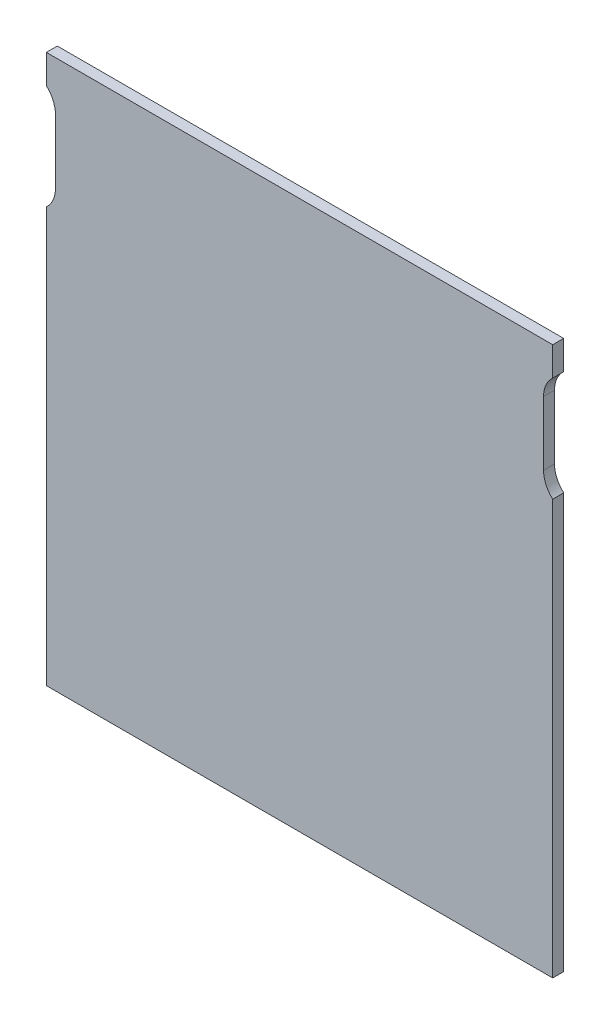
ISO-10303-21;
HEADER;
FILE_DESCRIPTION(('STEP AP214'),'2;1');
FILE_NAME('part.step','',(''),(''),'','','');
FILE_SCHEMA(('AUTOMOTIVE_DESIGN { 1 0 10303 214 1 1 1 1 }'));
ENDSEC;
DATA;
#1=APPLICATION_CONTEXT('core data for automotive mechanical design processes');
#2=APPLICATION_PROTOCOL_DEFINITION('international standard','automotive_design',2000,#1);
#3=PRODUCT_CONTEXT('',#1,'mechanical');
#4=PRODUCT('Part','Part','',(#3));
#5=PRODUCT_RELATED_PRODUCT_CATEGORY('part','',(#4));
#6=PRODUCT_DEFINITION_FORMATION('','',#4);
#7=PRODUCT_DEFINITION_CONTEXT('part definition',#1,'design');
#8=PRODUCT_DEFINITION('design','',#6,#7);
#9=PRODUCT_DEFINITION_SHAPE('','',#8);
#10=(LENGTH_UNIT() NAMED_UNIT(*) SI_UNIT(.MILLI.,.METRE.));
#11=(NAMED_UNIT(*) PLANE_ANGLE_UNIT() SI_UNIT($,.RADIAN.));
#12=(NAMED_UNIT(*) SI_UNIT($,.STERADIAN.) SOLID_ANGLE_UNIT());
#13=UNCERTAINTY_MEASURE_WITH_UNIT(LENGTH_MEASURE(1.E-05),#10,'distance_accuracy_value','');
#14=(GEOMETRIC_REPRESENTATION_CONTEXT(3) GLOBAL_UNCERTAINTY_ASSIGNED_CONTEXT((#13)) GLOBAL_UNIT_ASSIGNED_CONTEXT((#10,
#11,#12)) REPRESENTATION_CONTEXT('',''));
#15=CARTESIAN_POINT('',(0.,0.,0.));
#16=DIRECTION('',(0.,0.,1.));
#17=DIRECTION('',(1.,0.,0.));
#18=AXIS2_PLACEMENT_3D('',#15,#16,#17);
#19=CARTESIAN_POINT('',(-138.5,-150.,6.));
#20=DIRECTION('',(-1.,0.,0.));
#21=DIRECTION('',(0.,0.,1.));
#22=AXIS2_PLACEMENT_3D('',#19,#20,#21);
#23=PLANE('',#22);
#24=DIRECTION('',(0.,1.,0.));
#25=VECTOR('',#24,1.);
#26=CARTESIAN_POINT('',(-138.5,-150.,0.));
#27=LINE('',#26,#25);
#28=CARTESIAN_POINT('',(-138.5,134.180339887499,0.));
#29=VERTEX_POINT('',#28);
#30=CARTESIAN_POINT('',(-138.5,150.,0.));
#31=VERTEX_POINT('',#30);
#32=EDGE_CURVE('E369',#29,#31,#27,.T.);
#33=ORIENTED_EDGE('',*,*,#32,.F.);
#34=DIRECTION('',(0.,0.,1.));
#35=VECTOR('',#34,1.);
#36=CARTESIAN_POINT('',(-138.5,134.180339887499,-12.));
#37=LINE('',#36,#35);
#38=CARTESIAN_POINT('',(-138.5,134.180339887499,6.));
#39=VERTEX_POINT('',#38);
#40=EDGE_CURVE('E221',#29,#39,#37,.T.);
#41=ORIENTED_EDGE('',*,*,#40,.T.);
#42=DIRECTION('',(0.,1.,0.));
#43=VECTOR('',#42,1.);
#44=CARTESIAN_POINT('',(-138.5,-150.,6.));
#45=LINE('',#44,#43);
#46=CARTESIAN_POINT('',(-138.5,150.,6.));
#47=VERTEX_POINT('',#46);
#48=EDGE_CURVE('E357',#39,#47,#45,.T.);
#49=ORIENTED_EDGE('',*,*,#48,.T.);
#50=DIRECTION('',(0.,0.,-1.));
#51=VECTOR('',#50,1.);
#52=CARTESIAN_POINT('',(-138.5,150.,6.));
#53=LINE('',#52,#51);
#54=EDGE_CURVE('E372',#47,#31,#53,.T.);
#55=ORIENTED_EDGE('',*,*,#54,.T.);
#56=EDGE_LOOP('',(#33,#41,#49,#55));
#57=FACE_BOUND('',#56,.T.);
#58=ADVANCED_FACE('F33',(#57),#23,.T.);
#59=CARTESIAN_POINT('',(-138.5,-150.,6.));
#60=VERTEX_POINT('',#59);
#61=CARTESIAN_POINT('',(-138.5,76.8196601125012,6.));
#62=VERTEX_POINT('',#61);
#63=EDGE_CURVE('E358',#60,#62,#45,.T.);
#64=ORIENTED_EDGE('',*,*,#63,.T.);
#65=DIRECTION('',(0.,0.,1.));
#66=VECTOR('',#65,1.);
#67=CARTESIAN_POINT('',(-138.5,76.8196601125012,-12.));
#68=LINE('',#67,#66);
#69=CARTESIAN_POINT('',(-138.5,76.8196601125012,0.));
#70=VERTEX_POINT('',#69);
#71=EDGE_CURVE('E48',#62,#70,#68,.F.);
#72=ORIENTED_EDGE('',*,*,#71,.T.);
#73=CARTESIAN_POINT('',(-138.5,-150.,0.));
#74=VERTEX_POINT('',#73);
#75=EDGE_CURVE('E351',#74,#70,#27,.T.);
#76=ORIENTED_EDGE('',*,*,#75,.F.);
#77=DIRECTION('',(0.,0.,-1.));
#78=VECTOR('',#77,1.);
#79=CARTESIAN_POINT('',(-138.5,-150.,6.));
#80=LINE('',#79,#78);
#81=EDGE_CURVE('E375',#60,#74,#80,.T.);
#82=ORIENTED_EDGE('',*,*,#81,.F.);
#83=EDGE_LOOP('',(#64,#72,#76,#82));
#84=FACE_BOUND('',#83,.T.);
#85=ADVANCED_FACE('F412',(#84),#23,.T.);
#86=CARTESIAN_POINT('',(138.5,-150.,6.));
#87=DIRECTION('',(-1.,0.,0.));
#88=DIRECTION('',(0.,0.,1.));
#89=AXIS2_PLACEMENT_3D('',#86,#87,#88);
#90=PLANE('',#89);
#91=DIRECTION('',(0.,1.,0.));
#92=VECTOR('',#91,1.);
#93=CARTESIAN_POINT('',(138.5,-150.,6.));
#94=LINE('',#93,#92);
#95=CARTESIAN_POINT('',(138.5,134.180339887499,6.));
#96=VERTEX_POINT('',#95);
#97=CARTESIAN_POINT('',(138.5,150.,6.));
#98=VERTEX_POINT('',#97);
#99=EDGE_CURVE('E350',#96,#98,#94,.T.);
#100=ORIENTED_EDGE('',*,*,#99,.F.);
#101=DIRECTION('',(0.,0.,1.));
#102=VECTOR('',#101,1.);
#103=CARTESIAN_POINT('',(138.5,134.180339887499,-12.));
#104=LINE('',#103,#102);
#105=CARTESIAN_POINT('',(138.5,134.180339887499,0.));
#106=VERTEX_POINT('',#105);
#107=EDGE_CURVE('E289',#96,#106,#104,.F.);
#108=ORIENTED_EDGE('',*,*,#107,.T.);
#109=DIRECTION('',(0.,1.,0.));
#110=VECTOR('',#109,1.);
#111=CARTESIAN_POINT('',(138.5,-150.,0.));
#112=LINE('',#111,#110);
#113=CARTESIAN_POINT('',(138.5,150.,0.));
#114=VERTEX_POINT('',#113);
#115=EDGE_CURVE('E363',#106,#114,#112,.T.);
#116=ORIENTED_EDGE('',*,*,#115,.T.);
#117=DIRECTION('',(0.,0.,-1.));
#118=VECTOR('',#117,1.);
#119=CARTESIAN_POINT('',(138.5,150.,6.));
#120=LINE('',#119,#118);
#121=EDGE_CURVE('E360',#98,#114,#120,.T.);
#122=ORIENTED_EDGE('',*,*,#121,.F.);
#123=EDGE_LOOP('',(#100,#108,#116,#122));
#124=FACE_BOUND('',#123,.T.);
#125=ADVANCED_FACE('F399',(#124),#90,.F.);
#126=CARTESIAN_POINT('',(0.,0.,0.));
#127=DIRECTION('',(0.,0.,1.));
#128=DIRECTION('',(1.,0.,0.));
#129=AXIS2_PLACEMENT_3D('',#126,#127,#128);
#130=PLANE('',#129);
#131=CARTESIAN_POINT('',(-148.5,123.,0.));
#132=DIRECTION('',(0.,0.,1.));
#133=DIRECTION('',(1.,0.,0.));
#134=AXIS2_PLACEMENT_3D('',#131,#132,#133);
#135=CIRCLE('',#134,15.);
#136=CARTESIAN_POINT('',(-133.5,123.,0.));
#137=VERTEX_POINT('',#136);
#138=EDGE_CURVE('E224',#29,#137,#135,.F.);
#139=ORIENTED_EDGE('',*,*,#138,.F.);
#140=ORIENTED_EDGE('',*,*,#32,.T.);
#141=DIRECTION('',(1.,0.,0.));
#142=VECTOR('',#141,1.);
#143=CARTESIAN_POINT('',(-138.5,150.,0.));
#144=LINE('',#143,#142);
#145=EDGE_CURVE('E346',#31,#114,#144,.T.);
#146=ORIENTED_EDGE('',*,*,#145,.T.);
#147=ORIENTED_EDGE('',*,*,#115,.F.);
#148=CARTESIAN_POINT('',(148.5,123.,0.));
#149=DIRECTION('',(0.,0.,1.));
#150=DIRECTION('',(1.,0.,0.));
#151=AXIS2_PLACEMENT_3D('',#148,#149,#150);
#152=CIRCLE('',#151,15.);
#153=CARTESIAN_POINT('',(133.5,123.,0.));
#154=VERTEX_POINT('',#153);
#155=EDGE_CURVE('E292',#106,#154,#152,.T.);
#156=ORIENTED_EDGE('',*,*,#155,.T.);
#157=DIRECTION('',(0.,-1.,0.));
#158=VECTOR('',#157,1.);
#159=CARTESIAN_POINT('',(133.5,-1.0586769556247E-13,0.));
#160=LINE('',#159,#158);
#161=CARTESIAN_POINT('',(133.5,88.,0.));
#162=VERTEX_POINT('',#161);
#163=EDGE_CURVE('E279',#154,#162,#160,.T.);
#164=ORIENTED_EDGE('',*,*,#163,.T.);
#165=CARTESIAN_POINT('',(148.5,88.,0.));
#166=DIRECTION('',(0.,0.,1.));
#167=DIRECTION('',(1.,0.,0.));
#168=AXIS2_PLACEMENT_3D('',#165,#166,#167);
#169=CIRCLE('',#168,15.);
#170=CARTESIAN_POINT('',(138.5,76.8196601125011,0.));
#171=VERTEX_POINT('',#170);
#172=EDGE_CURVE('E286',#162,#171,#169,.T.);
#173=ORIENTED_EDGE('',*,*,#172,.T.);
#174=CARTESIAN_POINT('',(138.5,-150.,0.));
#175=VERTEX_POINT('',#174);
#176=EDGE_CURVE('E364',#175,#171,#112,.T.);
#177=ORIENTED_EDGE('',*,*,#176,.F.);
#178=DIRECTION('',(1.,0.,0.));
#179=VECTOR('',#178,1.);
#180=CARTESIAN_POINT('',(-138.5,-150.,0.));
#181=LINE('',#180,#179);
#182=EDGE_CURVE('E367',#74,#175,#181,.T.);
#183=ORIENTED_EDGE('',*,*,#182,.F.);
#184=ORIENTED_EDGE('',*,*,#75,.T.);
#185=CARTESIAN_POINT('',(-148.5,88.,0.));
#186=DIRECTION('',(0.,0.,1.));
#187=DIRECTION('',(1.,0.,0.));
#188=AXIS2_PLACEMENT_3D('',#185,#186,#187);
#189=CIRCLE('',#188,15.);
#190=CARTESIAN_POINT('',(-133.5,88.,0.));
#191=VERTEX_POINT('',#190);
#192=EDGE_CURVE('E218',#191,#70,#189,.F.);
#193=ORIENTED_EDGE('',*,*,#192,.F.);
#194=DIRECTION('',(0.,-1.,0.));
#195=VECTOR('',#194,1.);
#196=CARTESIAN_POINT('',(-133.5,-1.0586769556247E-13,0.));
#197=LINE('',#196,#195);
#198=EDGE_CURVE('E202',#137,#191,#197,.T.);
#199=ORIENTED_EDGE('',*,*,#198,.F.);
#200=EDGE_LOOP('',(#139,#140,#146,#147,#156,#164,#173,#177,#183,#184,#193,#199));
#201=FACE_BOUND('',#200,.T.);
#202=DIRECTION('',(-0.989743318610787,0.142857142857143,0.));
#203=VECTOR('',#202,1.);
#204=CARTESIAN_POINT('',(-102.071428571429,-120.102566813892,0.));
#205=LINE('',#204,#203);
#206=CARTESIAN_POINT('',(-32.7893962686735,-130.102566813892,0.));
#207=VERTEX_POINT('',#206);
#208=CARTESIAN_POINT('',(-102.071428571429,-120.102566813892,0.));
#209=VERTEX_POINT('',#208);
#210=EDGE_CURVE('E258',#207,#209,#205,.T.);
#211=ORIENTED_EDGE('',*,*,#210,.T.);
#212=DIRECTION('',(-0.142857142857142,-0.989743318610787,0.));
#213=VECTOR('',#212,1.);
#214=CARTESIAN_POINT('',(-103.5,-130.,0.));
#215=LINE('',#214,#213);
#216=CARTESIAN_POINT('',(-103.5,-130.,0.));
#217=VERTEX_POINT('',#216);
#218=EDGE_CURVE('E250',#209,#217,#215,.T.);
#219=ORIENTED_EDGE('',*,*,#218,.T.);
#220=DIRECTION('',(0.989743318610787,-0.142857142857143,0.));
#221=VECTOR('',#220,1.);
#222=CARTESIAN_POINT('',(-103.5,-130.,0.));
#223=LINE('',#222,#221);
#224=CARTESIAN_POINT('',(-34.217967697245,-140.,0.));
#225=VERTEX_POINT('',#224);
#226=EDGE_CURVE('E255',#217,#225,#223,.T.);
#227=ORIENTED_EDGE('',*,*,#226,.T.);
#228=DIRECTION('',(0.142857142857143,0.989743318610787,0.));
#229=VECTOR('',#228,1.);
#230=CARTESIAN_POINT('',(-34.217967697245,-140.,0.));
#231=LINE('',#230,#229);
#232=EDGE_CURVE('E56',#225,#207,#231,.T.);
#233=ORIENTED_EDGE('',*,*,#232,.T.);
#234=EDGE_LOOP('',(#211,#219,#227,#233));
#235=FACE_BOUND('',#234,.T.);
#236=DIRECTION('',(0.142857142857142,-0.989743318610787,0.));
#237=VECTOR('',#236,1.);
#238=CARTESIAN_POINT('',(103.5,-130.,0.));
#239=LINE('',#238,#237);
#240=CARTESIAN_POINT('',(102.071428571429,-120.102566813892,0.));
#241=VERTEX_POINT('',#240);
#242=CARTESIAN_POINT('',(103.5,-130.,0.));
#243=VERTEX_POINT('',#242);
#244=EDGE_CURVE('E319',#241,#243,#239,.T.);
#245=ORIENTED_EDGE('',*,*,#244,.F.);
#246=DIRECTION('',(0.989743318610787,0.142857142857143,0.));
#247=VECTOR('',#246,1.);
#248=CARTESIAN_POINT('',(102.071428571429,-120.102566813892,0.));
#249=LINE('',#248,#247);
#250=CARTESIAN_POINT('',(32.7893962686735,-130.102566813892,0.));
#251=VERTEX_POINT('',#250);
#252=EDGE_CURVE('E324',#251,#241,#249,.T.);
#253=ORIENTED_EDGE('',*,*,#252,.F.);
#254=DIRECTION('',(-0.142857142857143,0.989743318610787,0.));
#255=VECTOR('',#254,1.);
#256=CARTESIAN_POINT('',(34.217967697245,-140.,0.));
#257=LINE('',#256,#255);
#258=CARTESIAN_POINT('',(34.217967697245,-140.,0.));
#259=VERTEX_POINT('',#258);
#260=EDGE_CURVE('E330',#259,#251,#257,.T.);
#261=ORIENTED_EDGE('',*,*,#260,.F.);
#262=DIRECTION('',(-0.989743318610787,-0.142857142857143,0.));
#263=VECTOR('',#262,1.);
#264=CARTESIAN_POINT('',(103.5,-130.,0.));
#265=LINE('',#264,#263);
#266=EDGE_CURVE('E327',#243,#259,#265,.T.);
#267=ORIENTED_EDGE('',*,*,#266,.F.);
#268=EDGE_LOOP('',(#245,#253,#261,#267));
#269=FACE_BOUND('',#268,.T.);
#270=ADVANCED_FACE('F394',(#201,#235,#269),#130,.F.);
#271=CARTESIAN_POINT('',(-138.5,150.,6.));
#272=DIRECTION('',(0.,1.,0.));
#273=DIRECTION('',(-1.,0.,0.));
#274=AXIS2_PLACEMENT_3D('',#271,#272,#273);
#275=PLANE('',#274);
#276=ORIENTED_EDGE('',*,*,#145,.F.);
#277=ORIENTED_EDGE('',*,*,#54,.F.);
#278=DIRECTION('',(1.,0.,0.));
#279=VECTOR('',#278,1.);
#280=CARTESIAN_POINT('',(-138.5,150.,6.));
#281=LINE('',#280,#279);
#282=EDGE_CURVE('E347',#47,#98,#281,.T.);
#283=ORIENTED_EDGE('',*,*,#282,.T.);
#284=ORIENTED_EDGE('',*,*,#121,.T.);
#285=EDGE_LOOP('',(#276,#277,#283,#284));
#286=FACE_BOUND('',#285,.T.);
#287=ADVANCED_FACE('F35',(#286),#275,.T.);
#288=CARTESIAN_POINT('',(-138.5,-150.,6.));
#289=DIRECTION('',(0.,1.,0.));
#290=DIRECTION('',(-1.,0.,0.));
#291=AXIS2_PLACEMENT_3D('',#288,#289,#290);
#292=PLANE('',#291);
#293=ORIENTED_EDGE('',*,*,#182,.T.);
#294=DIRECTION('',(0.,0.,-1.));
#295=VECTOR('',#294,1.);
#296=CARTESIAN_POINT('',(138.5,-150.,6.));
#297=LINE('',#296,#295);
#298=CARTESIAN_POINT('',(138.5,-150.,6.));
#299=VERTEX_POINT('',#298);
#300=EDGE_CURVE('E377',#299,#175,#297,.T.);
#301=ORIENTED_EDGE('',*,*,#300,.F.);
#302=DIRECTION('',(1.,0.,0.));
#303=VECTOR('',#302,1.);
#304=CARTESIAN_POINT('',(-138.5,-150.,6.));
#305=LINE('',#304,#303);
#306=EDGE_CURVE('E355',#60,#299,#305,.T.);
#307=ORIENTED_EDGE('',*,*,#306,.F.);
#308=ORIENTED_EDGE('',*,*,#81,.T.);
#309=EDGE_LOOP('',(#293,#301,#307,#308));
#310=FACE_BOUND('',#309,.T.);
#311=ADVANCED_FACE('F417',(#310),#292,.F.);
#312=ORIENTED_EDGE('',*,*,#176,.T.);
#313=DIRECTION('',(0.,0.,1.));
#314=VECTOR('',#313,1.);
#315=CARTESIAN_POINT('',(138.5,76.8196601125011,-12.));
#316=LINE('',#315,#314);
#317=CARTESIAN_POINT('',(138.5,76.8196601125011,6.));
#318=VERTEX_POINT('',#317);
#319=EDGE_CURVE('E283',#171,#318,#316,.T.);
#320=ORIENTED_EDGE('',*,*,#319,.T.);
#321=EDGE_CURVE('E352',#299,#318,#94,.T.);
#322=ORIENTED_EDGE('',*,*,#321,.F.);
#323=ORIENTED_EDGE('',*,*,#300,.T.);
#324=EDGE_LOOP('',(#312,#320,#322,#323));
#325=FACE_BOUND('',#324,.T.);
#326=ADVANCED_FACE('F419',(#325),#90,.F.);
#327=CARTESIAN_POINT('',(0.,0.,6.));
#328=DIRECTION('',(0.,0.,1.));
#329=DIRECTION('',(1.,0.,0.));
#330=AXIS2_PLACEMENT_3D('',#327,#328,#329);
#331=PLANE('',#330);
#332=ORIENTED_EDGE('',*,*,#48,.F.);
#333=CARTESIAN_POINT('',(-148.5,123.,6.));
#334=DIRECTION('',(0.,0.,1.));
#335=DIRECTION('',(1.,0.,0.));
#336=AXIS2_PLACEMENT_3D('',#333,#334,#335);
#337=CIRCLE('',#336,15.);
#338=CARTESIAN_POINT('',(-133.5,123.,6.));
#339=VERTEX_POINT('',#338);
#340=EDGE_CURVE('E11',#39,#339,#337,.F.);
#341=ORIENTED_EDGE('',*,*,#340,.T.);
#342=DIRECTION('',(0.,-1.,0.));
#343=VECTOR('',#342,1.);
#344=CARTESIAN_POINT('',(-133.5,123.,6.));
#345=LINE('',#344,#343);
#346=CARTESIAN_POINT('',(-133.5,88.,6.));
#347=VERTEX_POINT('',#346);
#348=EDGE_CURVE('E200',#339,#347,#345,.T.);
#349=ORIENTED_EDGE('',*,*,#348,.T.);
#350=CARTESIAN_POINT('',(-148.5,88.,6.));
#351=DIRECTION('',(0.,0.,-1.));
#352=DIRECTION('',(1.,0.,0.));
#353=AXIS2_PLACEMENT_3D('',#350,#351,#352);
#354=CIRCLE('',#353,15.);
#355=EDGE_CURVE('E206',#347,#62,#354,.T.);
#356=ORIENTED_EDGE('',*,*,#355,.T.);
#357=ORIENTED_EDGE('',*,*,#63,.F.);
#358=ORIENTED_EDGE('',*,*,#306,.T.);
#359=ORIENTED_EDGE('',*,*,#321,.T.);
#360=CARTESIAN_POINT('',(148.5,88.,6.));
#361=DIRECTION('',(0.,0.,1.));
#362=DIRECTION('',(-1.,0.,0.));
#363=AXIS2_PLACEMENT_3D('',#360,#361,#362);
#364=CIRCLE('',#363,15.);
#365=CARTESIAN_POINT('',(133.5,88.,6.));
#366=VERTEX_POINT('',#365);
#367=EDGE_CURVE('E274',#366,#318,#364,.T.);
#368=ORIENTED_EDGE('',*,*,#367,.F.);
#369=DIRECTION('',(0.,-1.,0.));
#370=VECTOR('',#369,1.);
#371=CARTESIAN_POINT('',(133.5,123.,6.));
#372=LINE('',#371,#370);
#373=CARTESIAN_POINT('',(133.5,123.,6.));
#374=VERTEX_POINT('',#373);
#375=EDGE_CURVE('E271',#374,#366,#372,.T.);
#376=ORIENTED_EDGE('',*,*,#375,.F.);
#377=CARTESIAN_POINT('',(148.5,123.,6.));
#378=DIRECTION('',(0.,0.,1.));
#379=DIRECTION('',(1.,0.,0.));
#380=AXIS2_PLACEMENT_3D('',#377,#378,#379);
#381=CIRCLE('',#380,15.);
#382=EDGE_CURVE('E41',#96,#374,#381,.T.);
#383=ORIENTED_EDGE('',*,*,#382,.F.);
#384=ORIENTED_EDGE('',*,*,#99,.T.);
#385=ORIENTED_EDGE('',*,*,#282,.F.);
#386=EDGE_LOOP('',(#332,#341,#349,#356,#357,#358,#359,#368,#376,#383,#384,#385));
#387=FACE_BOUND('',#386,.T.);
#388=ADVANCED_FACE('F213',(#387),#331,.T.);
#389=CARTESIAN_POINT('',(103.5,-130.,-7.));
#390=DIRECTION('',(-0.989743318610787,-0.142857142857142,0.));
#391=DIRECTION('',(0.142857142857142,-0.989743318610787,0.));
#392=AXIS2_PLACEMENT_3D('',#389,#390,#391);
#393=PLANE('',#392);
#394=ORIENTED_EDGE('',*,*,#244,.T.);
#395=DIRECTION('',(0.,0.,1.));
#396=VECTOR('',#395,1.);
#397=CARTESIAN_POINT('',(103.5,-130.,-7.));
#398=LINE('',#397,#396);
#399=CARTESIAN_POINT('',(103.5,-130.,-7.));
#400=VERTEX_POINT('',#399);
#401=EDGE_CURVE('E343',#400,#243,#398,.T.);
#402=ORIENTED_EDGE('',*,*,#401,.F.);
#403=DIRECTION('',(0.142857142857143,-0.989743318610787,0.));
#404=VECTOR('',#403,1.);
#405=CARTESIAN_POINT('',(102.071428571429,-120.102566813892,-7.));
#406=LINE('',#405,#404);
#407=CARTESIAN_POINT('',(104.214285714286,-134.948716593054,-7.));
#408=VERTEX_POINT('',#407);
#409=EDGE_CURVE('E295',#400,#408,#406,.T.);
#410=ORIENTED_EDGE('',*,*,#409,.T.);
#411=DIRECTION('',(0.,0.,1.));
#412=VECTOR('',#411,1.);
#413=CARTESIAN_POINT('',(104.214285714286,-134.948716593054,-12.));
#414=LINE('',#413,#412);
#415=CARTESIAN_POINT('',(104.214285714286,-134.948716593054,-12.));
#416=VERTEX_POINT('',#415);
#417=EDGE_CURVE('E316',#416,#408,#414,.T.);
#418=ORIENTED_EDGE('',*,*,#417,.F.);
#419=DIRECTION('',(0.142857142857143,-0.989743318610787,0.));
#420=VECTOR('',#419,1.);
#421=CARTESIAN_POINT('',(102.071428571429,-120.102566813892,-12.));
#422=LINE('',#421,#420);
#423=CARTESIAN_POINT('',(102.071428571429,-120.102566813892,-12.));
#424=VERTEX_POINT('',#423);
#425=EDGE_CURVE('E296',#424,#416,#422,.T.);
#426=ORIENTED_EDGE('',*,*,#425,.F.);
#427=DIRECTION('',(0.,0.,1.));
#428=VECTOR('',#427,1.);
#429=CARTESIAN_POINT('',(102.071428571429,-120.102566813892,-7.));
#430=LINE('',#429,#428);
#431=EDGE_CURVE('E323',#424,#241,#430,.T.);
#432=ORIENTED_EDGE('',*,*,#431,.T.);
#433=EDGE_LOOP('',(#394,#402,#410,#418,#426,#432));
#434=FACE_BOUND('',#433,.T.);
#435=ADVANCED_FACE('F446',(#434),#393,.F.);
#436=CARTESIAN_POINT('',(103.5,-130.,-7.));
#437=DIRECTION('',(-0.142857142857143,0.989743318610787,0.));
#438=DIRECTION('',(-0.989743318610787,-0.142857142857143,0.));
#439=AXIS2_PLACEMENT_3D('',#436,#437,#438);
#440=PLANE('',#439);
#441=ORIENTED_EDGE('',*,*,#266,.T.);
#442=DIRECTION('',(0.,0.,1.));
#443=VECTOR('',#442,1.);
#444=CARTESIAN_POINT('',(34.217967697245,-140.,-7.));
#445=LINE('',#444,#443);
#446=CARTESIAN_POINT('',(34.217967697245,-140.,-7.));
#447=VERTEX_POINT('',#446);
#448=EDGE_CURVE('E340',#447,#259,#445,.T.);
#449=ORIENTED_EDGE('',*,*,#448,.F.);
#450=DIRECTION('',(-0.989743318610787,-0.142857142857143,0.));
#451=VECTOR('',#450,1.);
#452=CARTESIAN_POINT('',(103.5,-130.,-7.));
#453=LINE('',#452,#451);
#454=EDGE_CURVE('E320',#400,#447,#453,.T.);
#455=ORIENTED_EDGE('',*,*,#454,.F.);
#456=ORIENTED_EDGE('',*,*,#401,.T.);
#457=EDGE_LOOP('',(#441,#449,#455,#456));
#458=FACE_BOUND('',#457,.T.);
#459=ADVANCED_FACE('F470',(#458),#440,.F.);
#460=CARTESIAN_POINT('',(34.217967697245,-140.,-7.));
#461=DIRECTION('',(0.989743318610787,0.142857142857143,0.));
#462=DIRECTION('',(-0.142857142857143,0.989743318610787,0.));
#463=AXIS2_PLACEMENT_3D('',#460,#461,#462);
#464=PLANE('',#463);
#465=ORIENTED_EDGE('',*,*,#260,.T.);
#466=DIRECTION('',(0.,0.,1.));
#467=VECTOR('',#466,1.);
#468=CARTESIAN_POINT('',(32.7893962686735,-130.102566813892,-7.));
#469=LINE('',#468,#467);
#470=CARTESIAN_POINT('',(32.7893962686735,-130.102566813892,-12.));
#471=VERTEX_POINT('',#470);
#472=EDGE_CURVE('E337',#471,#251,#469,.T.);
#473=ORIENTED_EDGE('',*,*,#472,.F.);
#474=DIRECTION('',(-0.142857142857143,0.989743318610787,0.));
#475=VECTOR('',#474,1.);
#476=CARTESIAN_POINT('',(32.7893962686735,-130.102566813892,-12.));
#477=LINE('',#476,#475);
#478=CARTESIAN_POINT('',(34.9322534115307,-144.948716593054,-12.));
#479=VERTEX_POINT('',#478);
#480=EDGE_CURVE('E302',#479,#471,#477,.T.);
#481=ORIENTED_EDGE('',*,*,#480,.F.);
#482=DIRECTION('',(0.,0.,1.));
#483=VECTOR('',#482,1.);
#484=CARTESIAN_POINT('',(34.9322534115307,-144.948716593054,-12.));
#485=LINE('',#484,#483);
#486=CARTESIAN_POINT('',(34.9322534115307,-144.948716593054,-7.));
#487=VERTEX_POINT('',#486);
#488=EDGE_CURVE('E308',#479,#487,#485,.T.);
#489=ORIENTED_EDGE('',*,*,#488,.T.);
#490=DIRECTION('',(-0.142857142857143,0.989743318610787,0.));
#491=VECTOR('',#490,1.);
#492=CARTESIAN_POINT('',(32.7893962686735,-130.102566813892,-7.));
#493=LINE('',#492,#491);
#494=EDGE_CURVE('E300',#487,#447,#493,.T.);
#495=ORIENTED_EDGE('',*,*,#494,.T.);
#496=ORIENTED_EDGE('',*,*,#448,.T.);
#497=EDGE_LOOP('',(#465,#473,#481,#489,#495,#496));
#498=FACE_BOUND('',#497,.T.);
#499=ADVANCED_FACE('F483',(#498),#464,.F.);
#500=CARTESIAN_POINT('',(102.071428571429,-120.102566813892,-7.));
#501=DIRECTION('',(0.142857142857143,-0.989743318610787,0.));
#502=DIRECTION('',(0.989743318610787,0.142857142857143,0.));
#503=AXIS2_PLACEMENT_3D('',#500,#501,#502);
#504=PLANE('',#503);
#505=ORIENTED_EDGE('',*,*,#252,.T.);
#506=ORIENTED_EDGE('',*,*,#431,.F.);
#507=DIRECTION('',(0.989743318610787,0.142857142857143,0.));
#508=VECTOR('',#507,1.);
#509=CARTESIAN_POINT('',(102.071428571429,-120.102566813892,-12.));
#510=LINE('',#509,#508);
#511=EDGE_CURVE('E305',#471,#424,#510,.T.);
#512=ORIENTED_EDGE('',*,*,#511,.F.);
#513=ORIENTED_EDGE('',*,*,#472,.T.);
#514=EDGE_LOOP('',(#505,#506,#512,#513));
#515=FACE_BOUND('',#514,.T.);
#516=ADVANCED_FACE('F493',(#515),#504,.F.);
#517=CARTESIAN_POINT('',(0.,0.,-7.));
#518=DIRECTION('',(0.,0.,-1.));
#519=DIRECTION('',(-1.,0.,0.));
#520=AXIS2_PLACEMENT_3D('',#517,#518,#519);
#521=PLANE('',#520);
#522=ORIENTED_EDGE('',*,*,#409,.F.);
#523=ORIENTED_EDGE('',*,*,#454,.T.);
#524=ORIENTED_EDGE('',*,*,#494,.F.);
#525=DIRECTION('',(-0.989743318610787,-0.142857142857143,0.));
#526=VECTOR('',#525,1.);
#527=CARTESIAN_POINT('',(104.214285714286,-134.948716593054,-7.));
#528=LINE('',#527,#526);
#529=EDGE_CURVE('E310',#408,#487,#528,.T.);
#530=ORIENTED_EDGE('',*,*,#529,.F.);
#531=EDGE_LOOP('',(#522,#523,#524,#530));
#532=FACE_BOUND('',#531,.T.);
#533=ADVANCED_FACE('F503',(#532),#521,.F.);
#534=CARTESIAN_POINT('',(104.214285714286,-134.948716593054,-12.));
#535=DIRECTION('',(-0.142857142857143,0.989743318610787,0.));
#536=DIRECTION('',(-0.989743318610787,-0.142857142857143,0.));
#537=AXIS2_PLACEMENT_3D('',#534,#535,#536);
#538=PLANE('',#537);
#539=ORIENTED_EDGE('',*,*,#529,.T.);
#540=ORIENTED_EDGE('',*,*,#488,.F.);
#541=DIRECTION('',(-0.989743318610787,-0.142857142857143,0.));
#542=VECTOR('',#541,1.);
#543=CARTESIAN_POINT('',(104.214285714286,-134.948716593054,-12.));
#544=LINE('',#543,#542);
#545=EDGE_CURVE('E299',#416,#479,#544,.T.);
#546=ORIENTED_EDGE('',*,*,#545,.F.);
#547=ORIENTED_EDGE('',*,*,#417,.T.);
#548=EDGE_LOOP('',(#539,#540,#546,#547));
#549=FACE_BOUND('',#548,.T.);
#550=ADVANCED_FACE('F513',(#549),#538,.F.);
#551=CARTESIAN_POINT('',(0.,0.,-12.));
#552=DIRECTION('',(0.,0.,-1.));
#553=DIRECTION('',(-1.,0.,0.));
#554=AXIS2_PLACEMENT_3D('',#551,#552,#553);
#555=PLANE('',#554);
#556=ORIENTED_EDGE('',*,*,#425,.T.);
#557=ORIENTED_EDGE('',*,*,#545,.T.);
#558=ORIENTED_EDGE('',*,*,#480,.T.);
#559=ORIENTED_EDGE('',*,*,#511,.T.);
#560=EDGE_LOOP('',(#556,#557,#558,#559));
#561=FACE_BOUND('',#560,.T.);
#562=ADVANCED_FACE('F430',(#561),#555,.T.);
#563=CARTESIAN_POINT('',(148.5,123.,-12.));
#564=DIRECTION('',(0.,0.,1.));
#565=DIRECTION('',(1.,0.,0.));
#566=AXIS2_PLACEMENT_3D('',#563,#564,#565);
#567=CYLINDRICAL_SURFACE('',#566,15.);
#568=ORIENTED_EDGE('',*,*,#107,.F.);
#569=ORIENTED_EDGE('',*,*,#382,.T.);
#570=DIRECTION('',(0.,0.,1.));
#571=VECTOR('',#570,1.);
#572=CARTESIAN_POINT('',(133.5,123.,-12.));
#573=LINE('',#572,#571);
#574=EDGE_CURVE('E276',#154,#374,#573,.T.);
#575=ORIENTED_EDGE('',*,*,#574,.F.);
#576=ORIENTED_EDGE('',*,*,#155,.F.);
#577=EDGE_LOOP('',(#568,#569,#575,#576));
#578=FACE_BOUND('',#577,.T.);
#579=ADVANCED_FACE('F386',(#578),#567,.F.);
#580=CARTESIAN_POINT('',(148.5,88.,-12.));
#581=DIRECTION('',(0.,0.,1.));
#582=DIRECTION('',(1.,0.,0.));
#583=AXIS2_PLACEMENT_3D('',#580,#581,#582);
#584=CYLINDRICAL_SURFACE('',#583,15.);
#585=DIRECTION('',(0.,0.,1.));
#586=VECTOR('',#585,1.);
#587=CARTESIAN_POINT('',(133.5,88.,-12.));
#588=LINE('',#587,#586);
#589=EDGE_CURVE('E277',#162,#366,#588,.T.);
#590=ORIENTED_EDGE('',*,*,#589,.T.);
#591=ORIENTED_EDGE('',*,*,#367,.T.);
#592=ORIENTED_EDGE('',*,*,#319,.F.);
#593=ORIENTED_EDGE('',*,*,#172,.F.);
#594=EDGE_LOOP('',(#590,#591,#592,#593));
#595=FACE_BOUND('',#594,.T.);
#596=ADVANCED_FACE('F421',(#595),#584,.F.);
#597=CARTESIAN_POINT('',(133.5,123.,-12.));
#598=DIRECTION('',(-1.,0.,0.));
#599=DIRECTION('',(0.,-1.,0.));
#600=AXIS2_PLACEMENT_3D('',#597,#598,#599);
#601=PLANE('',#600);
#602=ORIENTED_EDGE('',*,*,#574,.T.);
#603=ORIENTED_EDGE('',*,*,#375,.T.);
#604=ORIENTED_EDGE('',*,*,#589,.F.);
#605=ORIENTED_EDGE('',*,*,#163,.F.);
#606=EDGE_LOOP('',(#602,#603,#604,#605));
#607=FACE_BOUND('',#606,.T.);
#608=ADVANCED_FACE('F391',(#607),#601,.F.);
#609=CARTESIAN_POINT('',(-103.5,-130.,-7.));
#610=DIRECTION('',(-0.989743318610787,0.142857142857142,0.));
#611=DIRECTION('',(-0.142857142857142,-0.989743318610787,0.));
#612=AXIS2_PLACEMENT_3D('',#609,#610,#611);
#613=PLANE('',#612);
#614=ORIENTED_EDGE('',*,*,#218,.F.);
#615=DIRECTION('',(0.,0.,1.));
#616=VECTOR('',#615,1.);
#617=CARTESIAN_POINT('',(-102.071428571429,-120.102566813892,-7.));
#618=LINE('',#617,#616);
#619=CARTESIAN_POINT('',(-102.071428571429,-120.102566813892,-12.));
#620=VERTEX_POINT('',#619);
#621=EDGE_CURVE('E269',#620,#209,#618,.T.);
#622=ORIENTED_EDGE('',*,*,#621,.F.);
#623=DIRECTION('',(-0.142857142857143,-0.989743318610787,0.));
#624=VECTOR('',#623,1.);
#625=CARTESIAN_POINT('',(-102.071428571429,-120.102566813892,-12.));
#626=LINE('',#625,#624);
#627=CARTESIAN_POINT('',(-104.214285714286,-134.948716593054,-12.));
#628=VERTEX_POINT('',#627);
#629=EDGE_CURVE('E227',#620,#628,#626,.T.);
#630=ORIENTED_EDGE('',*,*,#629,.T.);
#631=DIRECTION('',(0.,0.,1.));
#632=VECTOR('',#631,1.);
#633=CARTESIAN_POINT('',(-104.214285714286,-134.948716593054,-12.));
#634=LINE('',#633,#632);
#635=CARTESIAN_POINT('',(-104.214285714286,-134.948716593054,-7.));
#636=VERTEX_POINT('',#635);
#637=EDGE_CURVE('E240',#628,#636,#634,.T.);
#638=ORIENTED_EDGE('',*,*,#637,.T.);
#639=DIRECTION('',(-0.142857142857143,-0.989743318610787,0.));
#640=VECTOR('',#639,1.);
#641=CARTESIAN_POINT('',(-102.071428571429,-120.102566813892,-7.));
#642=LINE('',#641,#640);
#643=CARTESIAN_POINT('',(-103.5,-130.,-7.));
#644=VERTEX_POINT('',#643);
#645=EDGE_CURVE('E226',#644,#636,#642,.T.);
#646=ORIENTED_EDGE('',*,*,#645,.F.);
#647=DIRECTION('',(0.,0.,1.));
#648=VECTOR('',#647,1.);
#649=CARTESIAN_POINT('',(-103.5,-130.,-7.));
#650=LINE('',#649,#648);
#651=EDGE_CURVE('E254',#644,#217,#650,.T.);
#652=ORIENTED_EDGE('',*,*,#651,.T.);
#653=EDGE_LOOP('',(#614,#622,#630,#638,#646,#652));
#654=FACE_BOUND('',#653,.T.);
#655=ADVANCED_FACE('F428',(#654),#613,.T.);
#656=CARTESIAN_POINT('',(-102.071428571429,-120.102566813892,-7.));
#657=DIRECTION('',(0.142857142857143,0.989743318610787,0.));
#658=DIRECTION('',(-0.989743318610787,0.142857142857143,0.));
#659=AXIS2_PLACEMENT_3D('',#656,#657,#658);
#660=PLANE('',#659);
#661=ORIENTED_EDGE('',*,*,#210,.F.);
#662=DIRECTION('',(0.,0.,1.));
#663=VECTOR('',#662,1.);
#664=CARTESIAN_POINT('',(-32.7893962686735,-130.102566813892,-7.));
#665=LINE('',#664,#663);
#666=CARTESIAN_POINT('',(-32.7893962686735,-130.102566813892,-12.));
#667=VERTEX_POINT('',#666);
#668=EDGE_CURVE('E267',#667,#207,#665,.T.);
#669=ORIENTED_EDGE('',*,*,#668,.F.);
#670=DIRECTION('',(-0.989743318610787,0.142857142857143,0.));
#671=VECTOR('',#670,1.);
#672=CARTESIAN_POINT('',(-102.071428571429,-120.102566813892,-12.));
#673=LINE('',#672,#671);
#674=EDGE_CURVE('E230',#667,#620,#673,.T.);
#675=ORIENTED_EDGE('',*,*,#674,.T.);
#676=ORIENTED_EDGE('',*,*,#621,.T.);
#677=EDGE_LOOP('',(#661,#669,#675,#676));
#678=FACE_BOUND('',#677,.T.);
#679=ADVANCED_FACE('F587',(#678),#660,.T.);
#680=CARTESIAN_POINT('',(-34.217967697245,-140.,-7.));
#681=DIRECTION('',(0.989743318610787,-0.142857142857143,0.));
#682=DIRECTION('',(0.142857142857143,0.989743318610787,0.));
#683=AXIS2_PLACEMENT_3D('',#680,#681,#682);
#684=PLANE('',#683);
#685=ORIENTED_EDGE('',*,*,#232,.F.);
#686=DIRECTION('',(0.,0.,1.));
#687=VECTOR('',#686,1.);
#688=CARTESIAN_POINT('',(-34.217967697245,-140.,-7.));
#689=LINE('',#688,#687);
#690=CARTESIAN_POINT('',(-34.217967697245,-140.,-7.));
#691=VERTEX_POINT('',#690);
#692=EDGE_CURVE('E265',#691,#225,#689,.T.);
#693=ORIENTED_EDGE('',*,*,#692,.F.);
#694=DIRECTION('',(0.142857142857143,0.989743318610787,0.));
#695=VECTOR('',#694,1.);
#696=CARTESIAN_POINT('',(-32.7893962686735,-130.102566813892,-7.));
#697=LINE('',#696,#695);
#698=CARTESIAN_POINT('',(-34.9322534115307,-144.948716593054,-7.));
#699=VERTEX_POINT('',#698);
#700=EDGE_CURVE('E242',#699,#691,#697,.T.);
#701=ORIENTED_EDGE('',*,*,#700,.F.);
#702=DIRECTION('',(0.,0.,1.));
#703=VECTOR('',#702,1.);
#704=CARTESIAN_POINT('',(-34.9322534115307,-144.948716593054,-12.));
#705=LINE('',#704,#703);
#706=CARTESIAN_POINT('',(-34.9322534115307,-144.948716593054,-12.));
#707=VERTEX_POINT('',#706);
#708=EDGE_CURVE('E248',#707,#699,#705,.T.);
#709=ORIENTED_EDGE('',*,*,#708,.F.);
#710=DIRECTION('',(0.142857142857143,0.989743318610787,0.));
#711=VECTOR('',#710,1.);
#712=CARTESIAN_POINT('',(-32.7893962686735,-130.102566813892,-12.));
#713=LINE('',#712,#711);
#714=EDGE_CURVE('E234',#707,#667,#713,.T.);
#715=ORIENTED_EDGE('',*,*,#714,.T.);
#716=ORIENTED_EDGE('',*,*,#668,.T.);
#717=EDGE_LOOP('',(#685,#693,#701,#709,#715,#716));
#718=FACE_BOUND('',#717,.T.);
#719=ADVANCED_FACE('F597',(#718),#684,.T.);
#720=CARTESIAN_POINT('',(-103.5,-130.,-7.));
#721=DIRECTION('',(-0.142857142857143,-0.989743318610787,0.));
#722=DIRECTION('',(0.989743318610787,-0.142857142857143,0.));
#723=AXIS2_PLACEMENT_3D('',#720,#721,#722);
#724=PLANE('',#723);
#725=ORIENTED_EDGE('',*,*,#226,.F.);
#726=ORIENTED_EDGE('',*,*,#651,.F.);
#727=DIRECTION('',(0.989743318610787,-0.142857142857143,0.));
#728=VECTOR('',#727,1.);
#729=CARTESIAN_POINT('',(-103.5,-130.,-7.));
#730=LINE('',#729,#728);
#731=EDGE_CURVE('E251',#644,#691,#730,.T.);
#732=ORIENTED_EDGE('',*,*,#731,.T.);
#733=ORIENTED_EDGE('',*,*,#692,.T.);
#734=EDGE_LOOP('',(#725,#726,#732,#733));
#735=FACE_BOUND('',#734,.T.);
#736=ADVANCED_FACE('F608',(#735),#724,.T.);
#737=CARTESIAN_POINT('',(-104.214285714286,-134.948716593054,-12.));
#738=DIRECTION('',(-0.142857142857143,-0.989743318610787,0.));
#739=DIRECTION('',(0.989743318610787,-0.142857142857143,0.));
#740=AXIS2_PLACEMENT_3D('',#737,#738,#739);
#741=PLANE('',#740);
#742=DIRECTION('',(0.989743318610787,-0.142857142857143,0.));
#743=VECTOR('',#742,1.);
#744=CARTESIAN_POINT('',(-104.214285714286,-134.948716593054,-7.));
#745=LINE('',#744,#743);
#746=EDGE_CURVE('E231',#636,#699,#745,.T.);
#747=ORIENTED_EDGE('',*,*,#746,.F.);
#748=ORIENTED_EDGE('',*,*,#637,.F.);
#749=DIRECTION('',(0.989743318610787,-0.142857142857143,0.));
#750=VECTOR('',#749,1.);
#751=CARTESIAN_POINT('',(-104.214285714286,-134.948716593054,-12.));
#752=LINE('',#751,#750);
#753=EDGE_CURVE('E237',#628,#707,#752,.T.);
#754=ORIENTED_EDGE('',*,*,#753,.T.);
#755=ORIENTED_EDGE('',*,*,#708,.T.);
#756=EDGE_LOOP('',(#747,#748,#754,#755));
#757=FACE_BOUND('',#756,.T.);
#758=ADVANCED_FACE('F618',(#757),#741,.T.);
#759=CARTESIAN_POINT('',(0.,0.,-12.));
#760=DIRECTION('',(0.,0.,-1.));
#761=DIRECTION('',(1.,0.,0.));
#762=AXIS2_PLACEMENT_3D('',#759,#760,#761);
#763=PLANE('',#762);
#764=ORIENTED_EDGE('',*,*,#629,.F.);
#765=ORIENTED_EDGE('',*,*,#674,.F.);
#766=ORIENTED_EDGE('',*,*,#714,.F.);
#767=ORIENTED_EDGE('',*,*,#753,.F.);
#768=EDGE_LOOP('',(#764,#765,#766,#767));
#769=FACE_BOUND('',#768,.T.);
#770=ADVANCED_FACE('F627',(#769),#763,.T.);
#771=CARTESIAN_POINT('',(0.,0.,-7.));
#772=DIRECTION('',(0.,0.,-1.));
#773=DIRECTION('',(1.,0.,0.));
#774=AXIS2_PLACEMENT_3D('',#771,#772,#773);
#775=PLANE('',#774);
#776=ORIENTED_EDGE('',*,*,#731,.F.);
#777=ORIENTED_EDGE('',*,*,#645,.T.);
#778=ORIENTED_EDGE('',*,*,#746,.T.);
#779=ORIENTED_EDGE('',*,*,#700,.T.);
#780=EDGE_LOOP('',(#776,#777,#778,#779));
#781=FACE_BOUND('',#780,.T.);
#782=ADVANCED_FACE('F637',(#781),#775,.F.);
#783=CARTESIAN_POINT('',(-148.5,123.,-12.));
#784=DIRECTION('',(0.,0.,1.));
#785=DIRECTION('',(1.,0.,0.));
#786=AXIS2_PLACEMENT_3D('',#783,#784,#785);
#787=CYLINDRICAL_SURFACE('',#786,15.);
#788=ORIENTED_EDGE('',*,*,#138,.T.);
#789=DIRECTION('',(0.,0.,1.));
#790=VECTOR('',#789,1.);
#791=CARTESIAN_POINT('',(-133.5,123.,-12.));
#792=LINE('',#791,#790);
#793=EDGE_CURVE('E204',#137,#339,#792,.T.);
#794=ORIENTED_EDGE('',*,*,#793,.T.);
#795=ORIENTED_EDGE('',*,*,#340,.F.);
#796=ORIENTED_EDGE('',*,*,#40,.F.);
#797=EDGE_LOOP('',(#788,#794,#795,#796));
#798=FACE_BOUND('',#797,.T.);
#799=ADVANCED_FACE('F408',(#798),#787,.F.);
#800=CARTESIAN_POINT('',(-133.5,123.,-12.));
#801=DIRECTION('',(-1.,0.,0.));
#802=DIRECTION('',(0.,-1.,0.));
#803=AXIS2_PLACEMENT_3D('',#800,#801,#802);
#804=PLANE('',#803);
#805=ORIENTED_EDGE('',*,*,#198,.T.);
#806=DIRECTION('',(0.,0.,1.));
#807=VECTOR('',#806,1.);
#808=CARTESIAN_POINT('',(-133.5,88.,-12.));
#809=LINE('',#808,#807);
#810=EDGE_CURVE('E196',#191,#347,#809,.T.);
#811=ORIENTED_EDGE('',*,*,#810,.T.);
#812=ORIENTED_EDGE('',*,*,#348,.F.);
#813=ORIENTED_EDGE('',*,*,#793,.F.);
#814=EDGE_LOOP('',(#805,#811,#812,#813));
#815=FACE_BOUND('',#814,.T.);
#816=ADVANCED_FACE('F197',(#815),#804,.T.);
#817=CARTESIAN_POINT('',(-148.5,88.,-12.));
#818=DIRECTION('',(0.,0.,1.));
#819=DIRECTION('',(1.,0.,0.));
#820=AXIS2_PLACEMENT_3D('',#817,#818,#819);
#821=CYLINDRICAL_SURFACE('',#820,15.);
#822=ORIENTED_EDGE('',*,*,#192,.T.);
#823=ORIENTED_EDGE('',*,*,#71,.F.);
#824=ORIENTED_EDGE('',*,*,#355,.F.);
#825=ORIENTED_EDGE('',*,*,#810,.F.);
#826=EDGE_LOOP('',(#822,#823,#824,#825));
#827=FACE_BOUND('',#826,.T.);
#828=ADVANCED_FACE('F207',(#827),#821,.F.);
#829=CLOSED_SHELL('',(#58,#85,#125,#270,#287,#311,#326,#388,#435,#459,#499,#516,#533,#550,#562,
#579,#596,#608,#655,#679,#719,#736,#758,#770,#782,#799,#816,#828));
#830=MANIFOLD_SOLID_BREP('B2',#829);
#831=ADVANCED_BREP_SHAPE_REPRESENTATION('',(#18,#830),#14);
#832=SHAPE_DEFINITION_REPRESENTATION(#9,#831);
ENDSEC;
END-ISO-10303-21;
